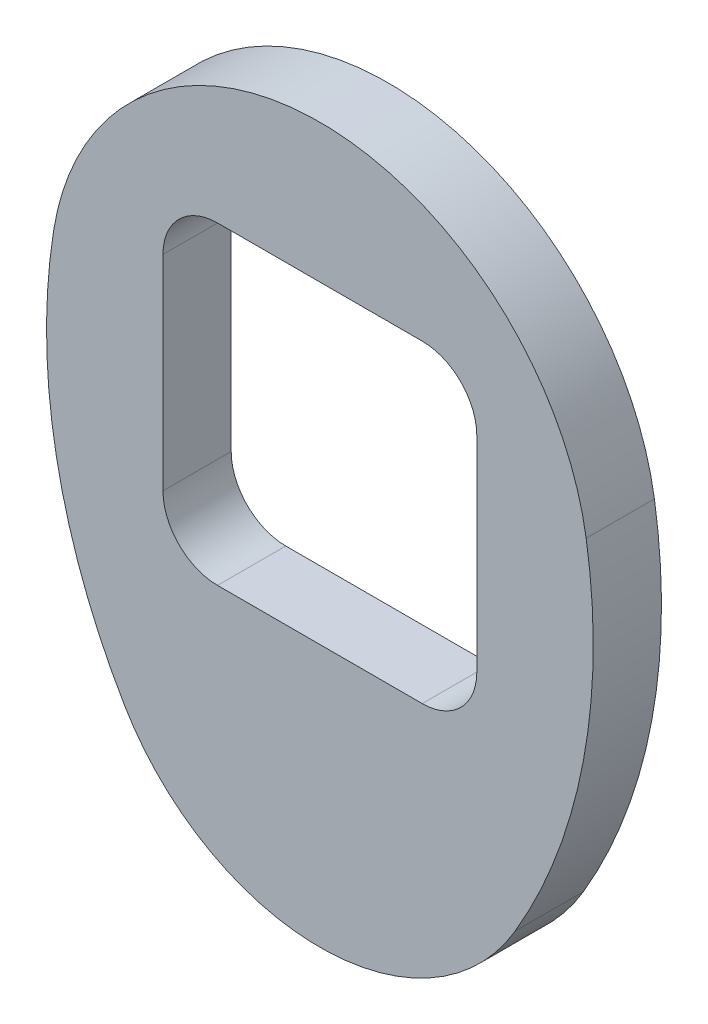
ISO-10303-21;
HEADER;
FILE_DESCRIPTION(('STEP AP214'),'2;1');
FILE_NAME('part.step','',(''),(''),'','','');
FILE_SCHEMA(('AUTOMOTIVE_DESIGN { 1 0 10303 214 1 1 1 1 }'));
ENDSEC;
DATA;
#1=APPLICATION_CONTEXT('core data for automotive mechanical design processes');
#2=APPLICATION_PROTOCOL_DEFINITION('international standard','automotive_design',2000,#1);
#3=PRODUCT_CONTEXT('',#1,'mechanical');
#4=PRODUCT('Part','Part','',(#3));
#5=PRODUCT_RELATED_PRODUCT_CATEGORY('part','',(#4));
#6=PRODUCT_DEFINITION_FORMATION('','',#4);
#7=PRODUCT_DEFINITION_CONTEXT('part definition',#1,'design');
#8=PRODUCT_DEFINITION('design','',#6,#7);
#9=PRODUCT_DEFINITION_SHAPE('','',#8);
#10=(LENGTH_UNIT() NAMED_UNIT(*) SI_UNIT(.MILLI.,.METRE.));
#11=(NAMED_UNIT(*) PLANE_ANGLE_UNIT() SI_UNIT($,.RADIAN.));
#12=(NAMED_UNIT(*) SI_UNIT($,.STERADIAN.) SOLID_ANGLE_UNIT());
#13=UNCERTAINTY_MEASURE_WITH_UNIT(LENGTH_MEASURE(1.E-05),#10,'distance_accuracy_value','');
#14=(GEOMETRIC_REPRESENTATION_CONTEXT(3) GLOBAL_UNCERTAINTY_ASSIGNED_CONTEXT((#13)) GLOBAL_UNIT_ASSIGNED_CONTEXT((#10,
#11,#12)) REPRESENTATION_CONTEXT('',''));
#15=CARTESIAN_POINT('',(0.,0.,0.));
#16=DIRECTION('',(0.,0.,1.));
#17=DIRECTION('',(1.,0.,0.));
#18=AXIS2_PLACEMENT_3D('',#15,#16,#17);
#19=CARTESIAN_POINT('',(0.,27.7979091364925,6.35));
#20=DIRECTION('',(0.,0.,-1.));
#21=DIRECTION('',(-1.,0.,0.));
#22=AXIS2_PLACEMENT_3D('',#19,#20,#21);
#23=CYLINDRICAL_SURFACE('',#22,25.0971340864688);
#24=CARTESIAN_POINT('',(0.,27.7979091364925,0.));
#25=DIRECTION('',(0.,0.,1.));
#26=DIRECTION('',(1.,0.,0.));
#27=AXIS2_PLACEMENT_3D('',#24,#25,#26);
#28=CIRCLE('',#27,25.0971340864688);
#29=CARTESIAN_POINT('',(-24.7840093035968,31.75,0.));
#30=VERTEX_POINT('',#29);
#31=CARTESIAN_POINT('',(24.7840093035968,31.75,0.));
#32=VERTEX_POINT('',#31);
#33=EDGE_CURVE('E171',#30,#32,#28,.F.);
#34=ORIENTED_EDGE('',*,*,#33,.F.);
#35=DIRECTION('',(0.,0.,-1.));
#36=VECTOR('',#35,1.);
#37=CARTESIAN_POINT('',(-24.7840093035968,31.75,6.35));
#38=LINE('',#37,#36);
#39=CARTESIAN_POINT('',(-24.7840093035968,31.75,6.35));
#40=VERTEX_POINT('',#39);
#41=EDGE_CURVE('E166',#40,#30,#38,.T.);
#42=ORIENTED_EDGE('',*,*,#41,.F.);
#43=CARTESIAN_POINT('',(0.,27.7979091364925,6.35));
#44=DIRECTION('',(0.,0.,1.));
#45=DIRECTION('',(1.,0.,0.));
#46=AXIS2_PLACEMENT_3D('',#43,#44,#45);
#47=CIRCLE('',#46,25.0971340864688);
#48=CARTESIAN_POINT('',(24.7840093035968,31.75,6.35));
#49=VERTEX_POINT('',#48);
#50=EDGE_CURVE('E169',#40,#49,#47,.F.);
#51=ORIENTED_EDGE('',*,*,#50,.T.);
#52=DIRECTION('',(0.,0.,-1.));
#53=VECTOR('',#52,1.);
#54=CARTESIAN_POINT('',(24.7840093035968,31.75,6.35));
#55=LINE('',#54,#53);
#56=EDGE_CURVE('E176',#49,#32,#55,.T.);
#57=ORIENTED_EDGE('',*,*,#56,.T.);
#58=EDGE_LOOP('',(#34,#42,#51,#57));
#59=FACE_BOUND('',#58,.T.);
#60=ADVANCED_FACE('F77',(#59),#23,.T.);
#61=CARTESIAN_POINT('',(0.,0.,6.35));
#62=DIRECTION('',(0.,0.,1.));
#63=DIRECTION('',(1.,0.,0.));
#64=AXIS2_PLACEMENT_3D('',#61,#62,#63);
#65=PLANE('',#64);
#66=DIRECTION('',(0.,1.,0.));
#67=VECTOR('',#66,1.);
#68=CARTESIAN_POINT('',(14.605,40.005,6.35));
#69=LINE('',#68,#67);
#70=CARTESIAN_POINT('',(14.605,15.875,6.35));
#71=VERTEX_POINT('',#70);
#72=CARTESIAN_POINT('',(14.605,34.925,6.35));
#73=VERTEX_POINT('',#72);
#74=EDGE_CURVE('E303',#71,#73,#69,.T.);
#75=ORIENTED_EDGE('',*,*,#74,.F.);
#76=CARTESIAN_POINT('',(9.525,15.875,6.35));
#77=DIRECTION('',(0.,0.,1.));
#78=DIRECTION('',(1.,0.,0.));
#79=AXIS2_PLACEMENT_3D('',#76,#77,#78);
#80=CIRCLE('',#79,5.08);
#81=CARTESIAN_POINT('',(9.52499999999999,10.795,6.35));
#82=VERTEX_POINT('',#81);
#83=EDGE_CURVE('E229',#71,#82,#80,.F.);
#84=ORIENTED_EDGE('',*,*,#83,.T.);
#85=DIRECTION('',(1.,0.,0.));
#86=VECTOR('',#85,1.);
#87=CARTESIAN_POINT('',(-14.605,10.795,6.35));
#88=LINE('',#87,#86);
#89=CARTESIAN_POINT('',(-9.525,10.795,6.35));
#90=VERTEX_POINT('',#89);
#91=EDGE_CURVE('E312',#90,#82,#88,.T.);
#92=ORIENTED_EDGE('',*,*,#91,.F.);
#93=CARTESIAN_POINT('',(-9.525,15.875,6.35));
#94=DIRECTION('',(0.,0.,1.));
#95=DIRECTION('',(1.,0.,0.));
#96=AXIS2_PLACEMENT_3D('',#93,#94,#95);
#97=CIRCLE('',#96,5.08);
#98=CARTESIAN_POINT('',(-14.605,15.875,6.35));
#99=VERTEX_POINT('',#98);
#100=EDGE_CURVE('E85',#90,#99,#97,.F.);
#101=ORIENTED_EDGE('',*,*,#100,.T.);
#102=DIRECTION('',(0.,-1.,0.));
#103=VECTOR('',#102,1.);
#104=CARTESIAN_POINT('',(-14.605,40.005,6.35));
#105=LINE('',#104,#103);
#106=CARTESIAN_POINT('',(-14.605,34.925,6.35));
#107=VERTEX_POINT('',#106);
#108=EDGE_CURVE('E311',#107,#99,#105,.T.);
#109=ORIENTED_EDGE('',*,*,#108,.F.);
#110=CARTESIAN_POINT('',(-9.525,34.925,6.35));
#111=DIRECTION('',(0.,0.,1.));
#112=DIRECTION('',(1.,0.,0.));
#113=AXIS2_PLACEMENT_3D('',#110,#111,#112);
#114=CIRCLE('',#113,5.08);
#115=CARTESIAN_POINT('',(-9.52500000000001,40.005,6.35));
#116=VERTEX_POINT('',#115);
#117=EDGE_CURVE('E99',#107,#116,#114,.F.);
#118=ORIENTED_EDGE('',*,*,#117,.T.);
#119=DIRECTION('',(-1.,0.,0.));
#120=VECTOR('',#119,1.);
#121=CARTESIAN_POINT('',(-14.605,40.005,6.35));
#122=LINE('',#121,#120);
#123=CARTESIAN_POINT('',(9.52499999999999,40.005,6.35));
#124=VERTEX_POINT('',#123);
#125=EDGE_CURVE('E305',#124,#116,#122,.T.);
#126=ORIENTED_EDGE('',*,*,#125,.F.);
#127=CARTESIAN_POINT('',(9.525,34.925,6.35));
#128=DIRECTION('',(0.,0.,1.));
#129=DIRECTION('',(1.,0.,0.));
#130=AXIS2_PLACEMENT_3D('',#127,#128,#129);
#131=CIRCLE('',#130,5.08);
#132=EDGE_CURVE('E233',#124,#73,#131,.F.);
#133=ORIENTED_EDGE('',*,*,#132,.T.);
#134=EDGE_LOOP('',(#75,#84,#92,#101,#109,#118,#126,#133));
#135=FACE_BOUND('',#134,.T.);
#136=CARTESIAN_POINT('',(0.,7.47215698276185,6.35));
#137=DIRECTION('',(0.,0.,1.));
#138=DIRECTION('',(1.,0.,0.));
#139=AXIS2_PLACEMENT_3D('',#136,#137,#138);
#140=CIRCLE('',#139,21.0850985736451);
#141=CARTESIAN_POINT('',(-18.1729868006611,-3.22008004245066,6.35));
#142=VERTEX_POINT('',#141);
#143=CARTESIAN_POINT('',(18.1729868006611,-3.22008004245069,6.35));
#144=VERTEX_POINT('',#143);
#145=EDGE_CURVE('E198',#142,#144,#140,.T.);
#146=ORIENTED_EDGE('',*,*,#145,.T.);
#147=CARTESIAN_POINT('',(-27.1800010535937,23.4637502633984,6.35));
#148=DIRECTION('',(0.,0.,-1.));
#149=DIRECTION('',(-1.,0.,0.));
#150=AXIS2_PLACEMENT_3D('',#147,#148,#149);
#151=CIRCLE('',#150,52.6205312316355);
#152=EDGE_CURVE('E186',#49,#144,#151,.T.);
#153=ORIENTED_EDGE('',*,*,#152,.F.);
#154=ORIENTED_EDGE('',*,*,#50,.F.);
#155=CARTESIAN_POINT('',(27.1800010535937,23.4637502633984,6.35));
#156=DIRECTION('',(0.,0.,1.));
#157=DIRECTION('',(1.,0.,0.));
#158=AXIS2_PLACEMENT_3D('',#155,#156,#157);
#159=CIRCLE('',#158,52.6205312316355);
#160=EDGE_CURVE('E179',#40,#142,#159,.T.);
#161=ORIENTED_EDGE('',*,*,#160,.T.);
#162=EDGE_LOOP('',(#146,#153,#154,#161));
#163=FACE_BOUND('',#162,.T.);
#164=ADVANCED_FACE('F189',(#135,#163),#65,.T.);
#165=CARTESIAN_POINT('',(0.,0.,0.));
#166=DIRECTION('',(0.,0.,1.));
#167=DIRECTION('',(1.,0.,0.));
#168=AXIS2_PLACEMENT_3D('',#165,#166,#167);
#169=PLANE('',#168);
#170=DIRECTION('',(-1.,0.,0.));
#171=VECTOR('',#170,1.);
#172=CARTESIAN_POINT('',(-14.605,10.795,0.));
#173=LINE('',#172,#171);
#174=CARTESIAN_POINT('',(9.525,10.795,0.));
#175=VERTEX_POINT('',#174);
#176=CARTESIAN_POINT('',(-9.525,10.795,0.));
#177=VERTEX_POINT('',#176);
#178=EDGE_CURVE('E253',#175,#177,#173,.T.);
#179=ORIENTED_EDGE('',*,*,#178,.F.);
#180=CARTESIAN_POINT('',(9.525,15.875,0.));
#181=DIRECTION('',(0.,0.,1.));
#182=DIRECTION('',(1.,0.,0.));
#183=AXIS2_PLACEMENT_3D('',#180,#181,#182);
#184=CIRCLE('',#183,5.08);
#185=CARTESIAN_POINT('',(14.605,15.875,0.));
#186=VERTEX_POINT('',#185);
#187=EDGE_CURVE('E231',#175,#186,#184,.T.);
#188=ORIENTED_EDGE('',*,*,#187,.T.);
#189=DIRECTION('',(0.,-1.,0.));
#190=VECTOR('',#189,1.);
#191=CARTESIAN_POINT('',(14.605,40.005,0.));
#192=LINE('',#191,#190);
#193=CARTESIAN_POINT('',(14.605,34.925,0.));
#194=VERTEX_POINT('',#193);
#195=EDGE_CURVE('E296',#194,#186,#192,.T.);
#196=ORIENTED_EDGE('',*,*,#195,.F.);
#197=CARTESIAN_POINT('',(9.525,34.925,0.));
#198=DIRECTION('',(0.,0.,1.));
#199=DIRECTION('',(1.,0.,0.));
#200=AXIS2_PLACEMENT_3D('',#197,#198,#199);
#201=CIRCLE('',#200,5.08);
#202=CARTESIAN_POINT('',(9.525,40.005,0.));
#203=VERTEX_POINT('',#202);
#204=EDGE_CURVE('E235',#194,#203,#201,.T.);
#205=ORIENTED_EDGE('',*,*,#204,.T.);
#206=DIRECTION('',(1.,0.,0.));
#207=VECTOR('',#206,1.);
#208=CARTESIAN_POINT('',(-14.605,40.005,0.));
#209=LINE('',#208,#207);
#210=CARTESIAN_POINT('',(-9.525,40.005,0.));
#211=VERTEX_POINT('',#210);
#212=EDGE_CURVE('E195',#211,#203,#209,.T.);
#213=ORIENTED_EDGE('',*,*,#212,.F.);
#214=CARTESIAN_POINT('',(-9.525,34.925,0.));
#215=DIRECTION('',(0.,0.,1.));
#216=DIRECTION('',(1.,0.,0.));
#217=AXIS2_PLACEMENT_3D('',#214,#215,#216);
#218=CIRCLE('',#217,5.08);
#219=CARTESIAN_POINT('',(-14.605,34.925,0.));
#220=VERTEX_POINT('',#219);
#221=EDGE_CURVE('E238',#211,#220,#218,.T.);
#222=ORIENTED_EDGE('',*,*,#221,.T.);
#223=DIRECTION('',(0.,1.,0.));
#224=VECTOR('',#223,1.);
#225=CARTESIAN_POINT('',(-14.605,40.005,0.));
#226=LINE('',#225,#224);
#227=CARTESIAN_POINT('',(-14.605,15.875,0.));
#228=VERTEX_POINT('',#227);
#229=EDGE_CURVE('E247',#228,#220,#226,.T.);
#230=ORIENTED_EDGE('',*,*,#229,.F.);
#231=CARTESIAN_POINT('',(-9.525,15.875,0.));
#232=DIRECTION('',(0.,0.,1.));
#233=DIRECTION('',(1.,0.,0.));
#234=AXIS2_PLACEMENT_3D('',#231,#232,#233);
#235=CIRCLE('',#234,5.08);
#236=EDGE_CURVE('E12',#228,#177,#235,.T.);
#237=ORIENTED_EDGE('',*,*,#236,.T.);
#238=EDGE_LOOP('',(#179,#188,#196,#205,#213,#222,#230,#237));
#239=FACE_BOUND('',#238,.T.);
#240=CARTESIAN_POINT('',(-27.1800010535937,23.4637502633984,0.));
#241=DIRECTION('',(0.,0.,-1.));
#242=DIRECTION('',(-1.,0.,0.));
#243=AXIS2_PLACEMENT_3D('',#240,#241,#242);
#244=CIRCLE('',#243,52.6205312316355);
#245=CARTESIAN_POINT('',(18.1729868006611,-3.22008004245069,0.));
#246=VERTEX_POINT('',#245);
#247=EDGE_CURVE('E207',#32,#246,#244,.T.);
#248=ORIENTED_EDGE('',*,*,#247,.T.);
#249=CARTESIAN_POINT('',(0.,7.47215698276185,0.));
#250=DIRECTION('',(0.,0.,1.));
#251=DIRECTION('',(1.,0.,0.));
#252=AXIS2_PLACEMENT_3D('',#249,#250,#251);
#253=CIRCLE('',#252,21.0850985736451);
#254=CARTESIAN_POINT('',(-18.1729868006611,-3.22008004245066,0.));
#255=VERTEX_POINT('',#254);
#256=EDGE_CURVE('E185',#255,#246,#253,.T.);
#257=ORIENTED_EDGE('',*,*,#256,.F.);
#258=CARTESIAN_POINT('',(27.1800010535937,23.4637502633984,0.));
#259=DIRECTION('',(0.,0.,1.));
#260=DIRECTION('',(1.,0.,0.));
#261=AXIS2_PLACEMENT_3D('',#258,#259,#260);
#262=CIRCLE('',#261,52.6205312316355);
#263=EDGE_CURVE('E205',#30,#255,#262,.T.);
#264=ORIENTED_EDGE('',*,*,#263,.F.);
#265=ORIENTED_EDGE('',*,*,#33,.T.);
#266=EDGE_LOOP('',(#248,#257,#264,#265));
#267=FACE_BOUND('',#266,.T.);
#268=ADVANCED_FACE('F245',(#239,#267),#169,.F.);
#269=CARTESIAN_POINT('',(0.,7.47215698276185,6.35));
#270=DIRECTION('',(0.,0.,-1.));
#271=DIRECTION('',(-1.,0.,0.));
#272=AXIS2_PLACEMENT_3D('',#269,#270,#271);
#273=CYLINDRICAL_SURFACE('',#272,21.0850985736451);
#274=ORIENTED_EDGE('',*,*,#256,.T.);
#275=DIRECTION('',(0.,0.,-1.));
#276=VECTOR('',#275,1.);
#277=CARTESIAN_POINT('',(18.1729868006611,-3.22008004245069,6.35));
#278=LINE('',#277,#276);
#279=EDGE_CURVE('E200',#144,#246,#278,.T.);
#280=ORIENTED_EDGE('',*,*,#279,.F.);
#281=ORIENTED_EDGE('',*,*,#145,.F.);
#282=DIRECTION('',(0.,0.,-1.));
#283=VECTOR('',#282,1.);
#284=CARTESIAN_POINT('',(-18.1729868006611,-3.22008004245066,6.35));
#285=LINE('',#284,#283);
#286=EDGE_CURVE('E181',#142,#255,#285,.T.);
#287=ORIENTED_EDGE('',*,*,#286,.T.);
#288=EDGE_LOOP('',(#274,#280,#281,#287));
#289=FACE_BOUND('',#288,.T.);
#290=ADVANCED_FACE('F266',(#289),#273,.T.);
#291=CARTESIAN_POINT('',(27.1800010535937,23.4637502633984,6.35));
#292=DIRECTION('',(0.,0.,-1.));
#293=DIRECTION('',(-1.,0.,0.));
#294=AXIS2_PLACEMENT_3D('',#291,#292,#293);
#295=CYLINDRICAL_SURFACE('',#294,52.6205312316355);
#296=ORIENTED_EDGE('',*,*,#263,.T.);
#297=ORIENTED_EDGE('',*,*,#286,.F.);
#298=ORIENTED_EDGE('',*,*,#160,.F.);
#299=ORIENTED_EDGE('',*,*,#41,.T.);
#300=EDGE_LOOP('',(#296,#297,#298,#299));
#301=FACE_BOUND('',#300,.T.);
#302=ADVANCED_FACE('F180',(#301),#295,.T.);
#303=CARTESIAN_POINT('',(-27.1800010535937,23.4637502633984,6.35));
#304=DIRECTION('',(0.,0.,-1.));
#305=DIRECTION('',(-1.,0.,0.));
#306=AXIS2_PLACEMENT_3D('',#303,#304,#305);
#307=CYLINDRICAL_SURFACE('',#306,52.6205312316355);
#308=ORIENTED_EDGE('',*,*,#247,.F.);
#309=ORIENTED_EDGE('',*,*,#56,.F.);
#310=ORIENTED_EDGE('',*,*,#152,.T.);
#311=ORIENTED_EDGE('',*,*,#279,.T.);
#312=EDGE_LOOP('',(#308,#309,#310,#311));
#313=FACE_BOUND('',#312,.T.);
#314=ADVANCED_FACE('F274',(#313),#307,.T.);
#315=CARTESIAN_POINT('',(14.605,40.005,-0.00100000000000013));
#316=DIRECTION('',(1.,0.,0.));
#317=DIRECTION('',(0.,1.,0.));
#318=AXIS2_PLACEMENT_3D('',#315,#316,#317);
#319=PLANE('',#318);
#320=ORIENTED_EDGE('',*,*,#195,.T.);
#321=DIRECTION('',(0.,0.,1.));
#322=VECTOR('',#321,1.);
#323=CARTESIAN_POINT('',(14.605,15.875,6.35));
#324=LINE('',#323,#322);
#325=EDGE_CURVE('E212',#186,#71,#324,.T.);
#326=ORIENTED_EDGE('',*,*,#325,.T.);
#327=ORIENTED_EDGE('',*,*,#74,.T.);
#328=DIRECTION('',(0.,0.,1.));
#329=VECTOR('',#328,1.);
#330=CARTESIAN_POINT('',(14.605,34.925,0.));
#331=LINE('',#330,#329);
#332=EDGE_CURVE('E175',#73,#194,#331,.F.);
#333=ORIENTED_EDGE('',*,*,#332,.T.);
#334=EDGE_LOOP('',(#320,#326,#327,#333));
#335=FACE_BOUND('',#334,.T.);
#336=ADVANCED_FACE('F277',(#335),#319,.F.);
#337=CARTESIAN_POINT('',(-14.605,10.795,-0.00100000000000013));
#338=DIRECTION('',(0.,-1.,0.));
#339=DIRECTION('',(0.,0.,-1.));
#340=AXIS2_PLACEMENT_3D('',#337,#338,#339);
#341=PLANE('',#340);
#342=ORIENTED_EDGE('',*,*,#91,.T.);
#343=DIRECTION('',(0.,0.,1.));
#344=VECTOR('',#343,1.);
#345=CARTESIAN_POINT('',(9.525,10.795,0.));
#346=LINE('',#345,#344);
#347=EDGE_CURVE('E218',#82,#175,#346,.F.);
#348=ORIENTED_EDGE('',*,*,#347,.T.);
#349=ORIENTED_EDGE('',*,*,#178,.T.);
#350=DIRECTION('',(0.,0.,1.));
#351=VECTOR('',#350,1.);
#352=CARTESIAN_POINT('',(-9.525,10.795,6.35));
#353=LINE('',#352,#351);
#354=EDGE_CURVE('E215',#177,#90,#353,.T.);
#355=ORIENTED_EDGE('',*,*,#354,.T.);
#356=EDGE_LOOP('',(#342,#348,#349,#355));
#357=FACE_BOUND('',#356,.T.);
#358=ADVANCED_FACE('F318',(#357),#341,.F.);
#359=CARTESIAN_POINT('',(-14.605,40.005,-0.00100000000000013));
#360=DIRECTION('',(-1.,0.,0.));
#361=DIRECTION('',(0.,-1.,0.));
#362=AXIS2_PLACEMENT_3D('',#359,#360,#361);
#363=PLANE('',#362);
#364=ORIENTED_EDGE('',*,*,#229,.T.);
#365=DIRECTION('',(0.,0.,1.));
#366=VECTOR('',#365,1.);
#367=CARTESIAN_POINT('',(-14.605,34.925,6.35));
#368=LINE('',#367,#366);
#369=EDGE_CURVE('E227',#220,#107,#368,.T.);
#370=ORIENTED_EDGE('',*,*,#369,.T.);
#371=ORIENTED_EDGE('',*,*,#108,.T.);
#372=DIRECTION('',(0.,0.,1.));
#373=VECTOR('',#372,1.);
#374=CARTESIAN_POINT('',(-14.605,15.875,0.));
#375=LINE('',#374,#373);
#376=EDGE_CURVE('E225',#99,#228,#375,.F.);
#377=ORIENTED_EDGE('',*,*,#376,.T.);
#378=EDGE_LOOP('',(#364,#370,#371,#377));
#379=FACE_BOUND('',#378,.T.);
#380=ADVANCED_FACE('F251',(#379),#363,.F.);
#381=CARTESIAN_POINT('',(-14.605,40.005,-0.00100000000000013));
#382=DIRECTION('',(0.,1.,0.));
#383=DIRECTION('',(0.,0.,1.));
#384=AXIS2_PLACEMENT_3D('',#381,#382,#383);
#385=PLANE('',#384);
#386=ORIENTED_EDGE('',*,*,#212,.T.);
#387=DIRECTION('',(0.,0.,1.));
#388=VECTOR('',#387,1.);
#389=CARTESIAN_POINT('',(9.525,40.005,6.35));
#390=LINE('',#389,#388);
#391=EDGE_CURVE('E222',#203,#124,#390,.T.);
#392=ORIENTED_EDGE('',*,*,#391,.T.);
#393=ORIENTED_EDGE('',*,*,#125,.T.);
#394=DIRECTION('',(0.,0.,1.));
#395=VECTOR('',#394,1.);
#396=CARTESIAN_POINT('',(-9.525,40.005,0.));
#397=LINE('',#396,#395);
#398=EDGE_CURVE('E220',#116,#211,#397,.F.);
#399=ORIENTED_EDGE('',*,*,#398,.T.);
#400=EDGE_LOOP('',(#386,#392,#393,#399));
#401=FACE_BOUND('',#400,.T.);
#402=ADVANCED_FACE('F284',(#401),#385,.F.);
#403=CARTESIAN_POINT('',(9.525,15.875,-0.00100000000000013));
#404=DIRECTION('',(0.,0.,-1.));
#405=DIRECTION('',(-1.,0.,0.));
#406=AXIS2_PLACEMENT_3D('',#403,#404,#405);
#407=CYLINDRICAL_SURFACE('',#406,5.08);
#408=ORIENTED_EDGE('',*,*,#187,.F.);
#409=ORIENTED_EDGE('',*,*,#347,.F.);
#410=ORIENTED_EDGE('',*,*,#83,.F.);
#411=ORIENTED_EDGE('',*,*,#325,.F.);
#412=EDGE_LOOP('',(#408,#409,#410,#411));
#413=FACE_BOUND('',#412,.T.);
#414=ADVANCED_FACE('F263',(#413),#407,.F.);
#415=CARTESIAN_POINT('',(9.525,34.925,-0.00100000000000013));
#416=DIRECTION('',(0.,0.,-1.));
#417=DIRECTION('',(-1.,0.,0.));
#418=AXIS2_PLACEMENT_3D('',#415,#416,#417);
#419=CYLINDRICAL_SURFACE('',#418,5.08);
#420=ORIENTED_EDGE('',*,*,#204,.F.);
#421=ORIENTED_EDGE('',*,*,#332,.F.);
#422=ORIENTED_EDGE('',*,*,#132,.F.);
#423=ORIENTED_EDGE('',*,*,#391,.F.);
#424=EDGE_LOOP('',(#420,#421,#422,#423));
#425=FACE_BOUND('',#424,.T.);
#426=ADVANCED_FACE('F257',(#425),#419,.F.);
#427=CARTESIAN_POINT('',(-9.525,34.925,-0.00100000000000013));
#428=DIRECTION('',(0.,0.,-1.));
#429=DIRECTION('',(-1.,0.,0.));
#430=AXIS2_PLACEMENT_3D('',#427,#428,#429);
#431=CYLINDRICAL_SURFACE('',#430,5.08);
#432=ORIENTED_EDGE('',*,*,#221,.F.);
#433=ORIENTED_EDGE('',*,*,#398,.F.);
#434=ORIENTED_EDGE('',*,*,#117,.F.);
#435=ORIENTED_EDGE('',*,*,#369,.F.);
#436=EDGE_LOOP('',(#432,#433,#434,#435));
#437=FACE_BOUND('',#436,.T.);
#438=ADVANCED_FACE('F255',(#437),#431,.F.);
#439=CARTESIAN_POINT('',(-9.525,15.875,-0.00100000000000013));
#440=DIRECTION('',(0.,0.,-1.));
#441=DIRECTION('',(-1.,0.,0.));
#442=AXIS2_PLACEMENT_3D('',#439,#440,#441);
#443=CYLINDRICAL_SURFACE('',#442,5.08);
#444=ORIENTED_EDGE('',*,*,#236,.F.);
#445=ORIENTED_EDGE('',*,*,#376,.F.);
#446=ORIENTED_EDGE('',*,*,#100,.F.);
#447=ORIENTED_EDGE('',*,*,#354,.F.);
#448=EDGE_LOOP('',(#444,#445,#446,#447));
#449=FACE_BOUND('',#448,.T.);
#450=ADVANCED_FACE('F79',(#449),#443,.F.);
#451=CLOSED_SHELL('',(#60,#164,#268,#290,#302,#314,#336,#358,#380,#402,#414,#426,#438,#450));
#452=MANIFOLD_SOLID_BREP('B2',#451);
#453=ADVANCED_BREP_SHAPE_REPRESENTATION('',(#18,#452),#14);
#454=SHAPE_DEFINITION_REPRESENTATION(#9,#453);
ENDSEC;
END-ISO-10303-21;
